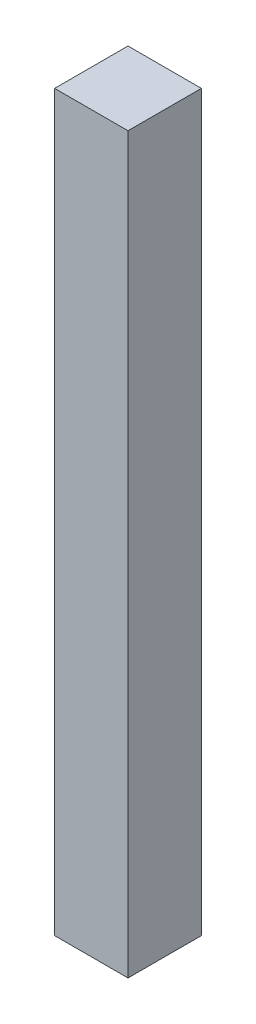
ISO-10303-21;
HEADER;
FILE_DESCRIPTION(('STEP AP214'),'2;1');
FILE_NAME('part.step','',(''),(''),'','','');
FILE_SCHEMA(('AUTOMOTIVE_DESIGN { 1 0 10303 214 1 1 1 1 }'));
ENDSEC;
DATA;
#1=APPLICATION_CONTEXT('core data for automotive mechanical design processes');
#2=APPLICATION_PROTOCOL_DEFINITION('international standard','automotive_design',2000,#1);
#3=PRODUCT_CONTEXT('',#1,'mechanical');
#4=PRODUCT('Part','Part','',(#3));
#5=PRODUCT_RELATED_PRODUCT_CATEGORY('part','',(#4));
#6=PRODUCT_DEFINITION_FORMATION('','',#4);
#7=PRODUCT_DEFINITION_CONTEXT('part definition',#1,'design');
#8=PRODUCT_DEFINITION('design','',#6,#7);
#9=PRODUCT_DEFINITION_SHAPE('','',#8);
#10=(LENGTH_UNIT() NAMED_UNIT(*) SI_UNIT(.MILLI.,.METRE.));
#11=(NAMED_UNIT(*) PLANE_ANGLE_UNIT() SI_UNIT($,.RADIAN.));
#12=(NAMED_UNIT(*) SI_UNIT($,.STERADIAN.) SOLID_ANGLE_UNIT());
#13=UNCERTAINTY_MEASURE_WITH_UNIT(LENGTH_MEASURE(1.E-05),#10,'distance_accuracy_value','');
#14=(GEOMETRIC_REPRESENTATION_CONTEXT(3) GLOBAL_UNCERTAINTY_ASSIGNED_CONTEXT((#13)) GLOBAL_UNIT_ASSIGNED_CONTEXT((#10,
#11,#12)) REPRESENTATION_CONTEXT('',''));
#15=CARTESIAN_POINT('',(0.,0.,0.));
#16=DIRECTION('',(0.,0.,1.));
#17=DIRECTION('',(1.,0.,0.));
#18=AXIS2_PLACEMENT_3D('',#15,#16,#17);
#19=CARTESIAN_POINT('',(0.,1200.,0.));
#20=DIRECTION('',(1.,0.,0.));
#21=DIRECTION('',(0.,0.,-1.));
#22=AXIS2_PLACEMENT_3D('',#19,#20,#21);
#23=PLANE('',#22);
#24=DIRECTION('',(0.,0.,1.));
#25=VECTOR('',#24,1.);
#26=CARTESIAN_POINT('',(0.,0.,0.));
#27=LINE('',#26,#25);
#28=CARTESIAN_POINT('',(0.,0.,-120.));
#29=VERTEX_POINT('',#28);
#30=CARTESIAN_POINT('',(0.,0.,0.));
#31=VERTEX_POINT('',#30);
#32=EDGE_CURVE('E97',#29,#31,#27,.T.);
#33=ORIENTED_EDGE('',*,*,#32,.T.);
#34=DIRECTION('',(0.,-1.,0.));
#35=VECTOR('',#34,1.);
#36=CARTESIAN_POINT('',(0.,1200.,0.));
#37=LINE('',#36,#35);
#38=CARTESIAN_POINT('',(0.,1200.,0.));
#39=VERTEX_POINT('',#38);
#40=EDGE_CURVE('E11',#39,#31,#37,.T.);
#41=ORIENTED_EDGE('',*,*,#40,.F.);
#42=DIRECTION('',(0.,0.,1.));
#43=VECTOR('',#42,1.);
#44=CARTESIAN_POINT('',(0.,1200.,0.));
#45=LINE('',#44,#43);
#46=CARTESIAN_POINT('',(0.,1200.,-120.));
#47=VERTEX_POINT('',#46);
#48=EDGE_CURVE('E85',#47,#39,#45,.T.);
#49=ORIENTED_EDGE('',*,*,#48,.F.);
#50=DIRECTION('',(0.,-1.,0.));
#51=VECTOR('',#50,1.);
#52=CARTESIAN_POINT('',(0.,1200.,-120.));
#53=LINE('',#52,#51);
#54=EDGE_CURVE('E93',#47,#29,#53,.T.);
#55=ORIENTED_EDGE('',*,*,#54,.T.);
#56=EDGE_LOOP('',(#33,#41,#49,#55));
#57=FACE_BOUND('',#56,.T.);
#58=ADVANCED_FACE('F34',(#57),#23,.F.);
#59=CARTESIAN_POINT('',(0.,1200.,0.));
#60=DIRECTION('',(0.,0.,-1.));
#61=DIRECTION('',(-1.,0.,0.));
#62=AXIS2_PLACEMENT_3D('',#59,#60,#61);
#63=PLANE('',#62);
#64=DIRECTION('',(1.,0.,0.));
#65=VECTOR('',#64,1.);
#66=CARTESIAN_POINT('',(0.,0.,0.));
#67=LINE('',#66,#65);
#68=CARTESIAN_POINT('',(120.,0.,0.));
#69=VERTEX_POINT('',#68);
#70=EDGE_CURVE('E89',#31,#69,#67,.T.);
#71=ORIENTED_EDGE('',*,*,#70,.T.);
#72=DIRECTION('',(0.,-1.,0.));
#73=VECTOR('',#72,1.);
#74=CARTESIAN_POINT('',(120.,1200.,0.));
#75=LINE('',#74,#73);
#76=CARTESIAN_POINT('',(120.,1200.,0.));
#77=VERTEX_POINT('',#76);
#78=EDGE_CURVE('E42',#77,#69,#75,.T.);
#79=ORIENTED_EDGE('',*,*,#78,.F.);
#80=DIRECTION('',(1.,0.,0.));
#81=VECTOR('',#80,1.);
#82=CARTESIAN_POINT('',(0.,1200.,0.));
#83=LINE('',#82,#81);
#84=EDGE_CURVE('E80',#39,#77,#83,.T.);
#85=ORIENTED_EDGE('',*,*,#84,.F.);
#86=ORIENTED_EDGE('',*,*,#40,.T.);
#87=EDGE_LOOP('',(#71,#79,#85,#86));
#88=FACE_BOUND('',#87,.T.);
#89=ADVANCED_FACE('F88',(#88),#63,.F.);
#90=CARTESIAN_POINT('',(120.,1200.,0.));
#91=DIRECTION('',(-1.,0.,0.));
#92=DIRECTION('',(0.,0.,1.));
#93=AXIS2_PLACEMENT_3D('',#90,#91,#92);
#94=PLANE('',#93);
#95=DIRECTION('',(0.,0.,-1.));
#96=VECTOR('',#95,1.);
#97=CARTESIAN_POINT('',(120.,0.,0.));
#98=LINE('',#97,#96);
#99=CARTESIAN_POINT('',(120.,0.,-120.));
#100=VERTEX_POINT('',#99);
#101=EDGE_CURVE('E67',#69,#100,#98,.T.);
#102=ORIENTED_EDGE('',*,*,#101,.T.);
#103=DIRECTION('',(0.,-1.,0.));
#104=VECTOR('',#103,1.);
#105=CARTESIAN_POINT('',(120.,1200.,-120.));
#106=LINE('',#105,#104);
#107=CARTESIAN_POINT('',(120.,1200.,-120.));
#108=VERTEX_POINT('',#107);
#109=EDGE_CURVE('E90',#108,#100,#106,.T.);
#110=ORIENTED_EDGE('',*,*,#109,.F.);
#111=DIRECTION('',(0.,0.,-1.));
#112=VECTOR('',#111,1.);
#113=CARTESIAN_POINT('',(120.,1200.,0.));
#114=LINE('',#113,#112);
#115=EDGE_CURVE('E83',#77,#108,#114,.T.);
#116=ORIENTED_EDGE('',*,*,#115,.F.);
#117=ORIENTED_EDGE('',*,*,#78,.T.);
#118=EDGE_LOOP('',(#102,#110,#116,#117));
#119=FACE_BOUND('',#118,.T.);
#120=ADVANCED_FACE('F91',(#119),#94,.F.);
#121=CARTESIAN_POINT('',(0.,1200.,-120.));
#122=DIRECTION('',(0.,0.,1.));
#123=DIRECTION('',(1.,0.,0.));
#124=AXIS2_PLACEMENT_3D('',#121,#122,#123);
#125=PLANE('',#124);
#126=DIRECTION('',(-1.,0.,0.));
#127=VECTOR('',#126,1.);
#128=CARTESIAN_POINT('',(0.,0.,-120.));
#129=LINE('',#128,#127);
#130=EDGE_CURVE('E73',#100,#29,#129,.T.);
#131=ORIENTED_EDGE('',*,*,#130,.T.);
#132=ORIENTED_EDGE('',*,*,#54,.F.);
#133=DIRECTION('',(-1.,0.,0.));
#134=VECTOR('',#133,1.);
#135=CARTESIAN_POINT('',(0.,1200.,-120.));
#136=LINE('',#135,#134);
#137=EDGE_CURVE('E50',#108,#47,#136,.T.);
#138=ORIENTED_EDGE('',*,*,#137,.F.);
#139=ORIENTED_EDGE('',*,*,#109,.T.);
#140=EDGE_LOOP('',(#131,#132,#138,#139));
#141=FACE_BOUND('',#140,.T.);
#142=ADVANCED_FACE('F104',(#141),#125,.F.);
#143=CARTESIAN_POINT('',(0.,1200.,0.));
#144=DIRECTION('',(0.,-1.,0.));
#145=DIRECTION('',(0.,0.,-1.));
#146=AXIS2_PLACEMENT_3D('',#143,#144,#145);
#147=PLANE('',#146);
#148=ORIENTED_EDGE('',*,*,#48,.T.);
#149=ORIENTED_EDGE('',*,*,#84,.T.);
#150=ORIENTED_EDGE('',*,*,#115,.T.);
#151=ORIENTED_EDGE('',*,*,#137,.T.);
#152=EDGE_LOOP('',(#148,#149,#150,#151));
#153=FACE_BOUND('',#152,.T.);
#154=ADVANCED_FACE('F81',(#153),#147,.F.);
#155=CARTESIAN_POINT('',(0.,0.,0.));
#156=DIRECTION('',(0.,-1.,0.));
#157=DIRECTION('',(0.,0.,-1.));
#158=AXIS2_PLACEMENT_3D('',#155,#156,#157);
#159=PLANE('',#158);
#160=ORIENTED_EDGE('',*,*,#32,.F.);
#161=ORIENTED_EDGE('',*,*,#130,.F.);
#162=ORIENTED_EDGE('',*,*,#101,.F.);
#163=ORIENTED_EDGE('',*,*,#70,.F.);
#164=EDGE_LOOP('',(#160,#161,#162,#163));
#165=FACE_BOUND('',#164,.T.);
#166=ADVANCED_FACE('F107',(#165),#159,.T.);
#167=CLOSED_SHELL('',(#58,#89,#120,#142,#154,#166));
#168=MANIFOLD_SOLID_BREP('B2',#167);
#169=ADVANCED_BREP_SHAPE_REPRESENTATION('',(#18,#168),#14);
#170=SHAPE_DEFINITION_REPRESENTATION(#9,#169);
ENDSEC;
END-ISO-10303-21;
